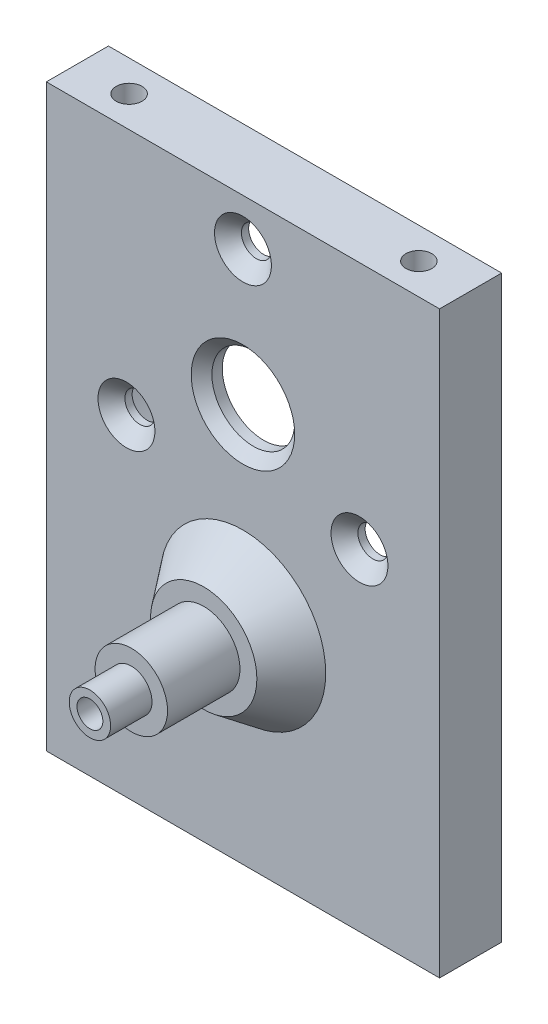
ISO-10303-21;
HEADER;
FILE_DESCRIPTION(('STEP AP214'),'2;1');
FILE_NAME('part.step','',(''),(''),'','','');
FILE_SCHEMA(('AUTOMOTIVE_DESIGN { 1 0 10303 214 1 1 1 1 }'));
ENDSEC;
DATA;
#1=APPLICATION_CONTEXT('core data for automotive mechanical design processes');
#2=APPLICATION_PROTOCOL_DEFINITION('international standard','automotive_design',2000,#1);
#3=PRODUCT_CONTEXT('',#1,'mechanical');
#4=PRODUCT('Part','Part','',(#3));
#5=PRODUCT_RELATED_PRODUCT_CATEGORY('part','',(#4));
#6=PRODUCT_DEFINITION_FORMATION('','',#4);
#7=PRODUCT_DEFINITION_CONTEXT('part definition',#1,'design');
#8=PRODUCT_DEFINITION('design','',#6,#7);
#9=PRODUCT_DEFINITION_SHAPE('','',#8);
#10=(LENGTH_UNIT() NAMED_UNIT(*) SI_UNIT(.MILLI.,.METRE.));
#11=(NAMED_UNIT(*) PLANE_ANGLE_UNIT() SI_UNIT($,.RADIAN.));
#12=(NAMED_UNIT(*) SI_UNIT($,.STERADIAN.) SOLID_ANGLE_UNIT());
#13=UNCERTAINTY_MEASURE_WITH_UNIT(LENGTH_MEASURE(1.E-05),#10,'distance_accuracy_value','');
#14=(GEOMETRIC_REPRESENTATION_CONTEXT(3) GLOBAL_UNCERTAINTY_ASSIGNED_CONTEXT((#13)) GLOBAL_UNIT_ASSIGNED_CONTEXT((#10,
#11,#12)) REPRESENTATION_CONTEXT('',''));
#15=CARTESIAN_POINT('',(0.,0.,0.));
#16=DIRECTION('',(0.,0.,1.));
#17=DIRECTION('',(1.,0.,0.));
#18=AXIS2_PLACEMENT_3D('',#15,#16,#17);
#19=CARTESIAN_POINT('',(0.,20.,16.79));
#20=DIRECTION('',(0.,0.,1.));
#21=DIRECTION('',(1.,0.,0.));
#22=AXIS2_PLACEMENT_3D('',#19,#20,#21);
#23=PLANE('',#22);
#24=CARTESIAN_POINT('',(0.,20.,16.79));
#25=DIRECTION('',(0.,0.,1.));
#26=DIRECTION('',(1.,0.,0.));
#27=AXIS2_PLACEMENT_3D('',#24,#25,#26);
#28=CIRCLE('',#27,3.5);
#29=CARTESIAN_POINT('',(3.5,20.,16.79));
#30=VERTEX_POINT('',#29);
#31=EDGE_CURVE('E157',#30,#30,#28,.T.);
#32=ORIENTED_EDGE('',*,*,#31,.T.);
#33=EDGE_LOOP('',(#32));
#34=FACE_BOUND('',#33,.T.);
#35=CARTESIAN_POINT('',(0.,20.,16.79));
#36=DIRECTION('',(0.,0.,1.));
#37=DIRECTION('',(1.,0.,0.));
#38=AXIS2_PLACEMENT_3D('',#35,#36,#37);
#39=CIRCLE('',#38,2.);
#40=CARTESIAN_POINT('',(2.,20.,16.79));
#41=VERTEX_POINT('',#40);
#42=EDGE_CURVE('E150',#41,#41,#39,.T.);
#43=ORIENTED_EDGE('',*,*,#42,.F.);
#44=EDGE_LOOP('',(#43));
#45=FACE_BOUND('',#44,.T.);
#46=ADVANCED_FACE('F37',(#34,#45),#23,.T.);
#47=CARTESIAN_POINT('',(0.,20.,9.79));
#48=DIRECTION('',(0.,0.,1.));
#49=DIRECTION('',(1.,0.,0.));
#50=AXIS2_PLACEMENT_3D('',#47,#48,#49);
#51=PLANE('',#50);
#52=CARTESIAN_POINT('',(0.,20.,9.79));
#53=DIRECTION('',(0.,0.,1.));
#54=DIRECTION('',(1.,0.,0.));
#55=AXIS2_PLACEMENT_3D('',#52,#53,#54);
#56=CIRCLE('',#55,5.13421550094518);
#57=CARTESIAN_POINT('',(5.13421550094518,20.,9.79));
#58=VERTEX_POINT('',#57);
#59=EDGE_CURVE('E222',#58,#58,#56,.T.);
#60=ORIENTED_EDGE('',*,*,#59,.T.);
#61=EDGE_LOOP('',(#60));
#62=FACE_BOUND('',#61,.T.);
#63=CARTESIAN_POINT('',(0.,20.,9.79));
#64=DIRECTION('',(0.,0.,1.));
#65=DIRECTION('',(1.,0.,0.));
#66=AXIS2_PLACEMENT_3D('',#63,#64,#65);
#67=CIRCLE('',#66,3.5);
#68=CARTESIAN_POINT('',(3.5,20.,9.79));
#69=VERTEX_POINT('',#68);
#70=EDGE_CURVE('E154',#69,#69,#67,.T.);
#71=ORIENTED_EDGE('',*,*,#70,.F.);
#72=EDGE_LOOP('',(#71));
#73=FACE_BOUND('',#72,.T.);
#74=ADVANCED_FACE('F238',(#62,#73),#51,.T.);
#75=CARTESIAN_POINT('',(0.,38.5,4.));
#76=DIRECTION('',(0.,0.,-1.));
#77=DIRECTION('',(-1.,0.,0.));
#78=AXIS2_PLACEMENT_3D('',#75,#76,#77);
#79=PLANE('',#78);
#80=CARTESIAN_POINT('',(-11.2583302491978,32.,4.));
#81=DIRECTION('',(0.,0.,-1.));
#82=DIRECTION('',(-1.,0.,0.));
#83=AXIS2_PLACEMENT_3D('',#80,#81,#82);
#84=CIRCLE('',#83,1.44999999999999);
#85=CARTESIAN_POINT('',(-12.7083302491978,32.,4.));
#86=VERTEX_POINT('',#85);
#87=EDGE_CURVE('E185',#86,#86,#84,.F.);
#88=ORIENTED_EDGE('',*,*,#87,.T.);
#89=EDGE_LOOP('',(#88));
#90=FACE_BOUND('',#89,.T.);
#91=CARTESIAN_POINT('',(0.,38.5,4.));
#92=DIRECTION('',(0.,0.,-1.));
#93=DIRECTION('',(-1.,0.,0.));
#94=AXIS2_PLACEMENT_3D('',#91,#92,#93);
#95=CIRCLE('',#94,4.00000000000001);
#96=CARTESIAN_POINT('',(-4.00000000000001,38.5,4.));
#97=VERTEX_POINT('',#96);
#98=EDGE_CURVE('E184',#97,#97,#95,.T.);
#99=ORIENTED_EDGE('',*,*,#98,.F.);
#100=EDGE_LOOP('',(#99));
#101=FACE_BOUND('',#100,.T.);
#102=CARTESIAN_POINT('',(0.,38.5,4.));
#103=DIRECTION('',(0.,0.,-1.));
#104=DIRECTION('',(-1.,0.,0.));
#105=AXIS2_PLACEMENT_3D('',#102,#103,#104);
#106=CIRCLE('',#105,16.54);
#107=CARTESIAN_POINT('',(-16.54,38.5,4.));
#108=VERTEX_POINT('',#107);
#109=EDGE_CURVE('E193',#108,#108,#106,.T.);
#110=ORIENTED_EDGE('',*,*,#109,.T.);
#111=EDGE_LOOP('',(#110));
#112=FACE_BOUND('',#111,.T.);
#113=CARTESIAN_POINT('',(11.2583302491976,31.9999999999999,4.));
#114=DIRECTION('',(0.,0.,-1.));
#115=DIRECTION('',(-1.,0.,0.));
#116=AXIS2_PLACEMENT_3D('',#113,#114,#115);
#117=CIRCLE('',#116,1.44999999999999);
#118=CARTESIAN_POINT('',(9.80833024919764,31.9999999999999,4.));
#119=VERTEX_POINT('',#118);
#120=EDGE_CURVE('E176',#119,#119,#117,.F.);
#121=ORIENTED_EDGE('',*,*,#120,.T.);
#122=EDGE_LOOP('',(#121));
#123=FACE_BOUND('',#122,.T.);
#124=CARTESIAN_POINT('',(0.,51.5,4.));
#125=DIRECTION('',(0.,0.,-1.));
#126=DIRECTION('',(-1.,0.,0.));
#127=AXIS2_PLACEMENT_3D('',#124,#125,#126);
#128=CIRCLE('',#127,1.44999999999999);
#129=CARTESIAN_POINT('',(-1.44999999999999,51.5,4.));
#130=VERTEX_POINT('',#129);
#131=EDGE_CURVE('E167',#130,#130,#128,.F.);
#132=ORIENTED_EDGE('',*,*,#131,.T.);
#133=EDGE_LOOP('',(#132));
#134=FACE_BOUND('',#133,.T.);
#135=ADVANCED_FACE('F244',(#90,#101,#112,#123,#134),#79,.T.);
#136=CARTESIAN_POINT('',(19.,56.,6.));
#137=DIRECTION('',(0.,0.,1.));
#138=DIRECTION('',(1.,0.,0.));
#139=AXIS2_PLACEMENT_3D('',#136,#137,#138);
#140=PLANE('',#139);
#141=CARTESIAN_POINT('',(0.,38.5,6.));
#142=DIRECTION('',(0.,0.,1.));
#143=DIRECTION('',(1.,0.,0.));
#144=AXIS2_PLACEMENT_3D('',#141,#142,#143);
#145=CIRCLE('',#144,5.);
#146=CARTESIAN_POINT('',(5.,38.5,6.));
#147=VERTEX_POINT('',#146);
#148=EDGE_CURVE('E46',#147,#147,#145,.F.);
#149=ORIENTED_EDGE('',*,*,#148,.T.);
#150=EDGE_LOOP('',(#149));
#151=FACE_BOUND('',#150,.T.);
#152=CARTESIAN_POINT('',(0.,20.,6.));
#153=DIRECTION('',(0.,0.,1.));
#154=DIRECTION('',(1.,0.,0.));
#155=AXIS2_PLACEMENT_3D('',#152,#153,#154);
#156=CIRCLE('',#155,8.);
#157=CARTESIAN_POINT('',(8.,20.,6.));
#158=VERTEX_POINT('',#157);
#159=EDGE_CURVE('E219',#158,#158,#156,.F.);
#160=ORIENTED_EDGE('',*,*,#159,.T.);
#161=EDGE_LOOP('',(#160));
#162=FACE_BOUND('',#161,.T.);
#163=CARTESIAN_POINT('',(0.,51.5,6.));
#164=DIRECTION('',(0.,0.,1.));
#165=DIRECTION('',(1.,0.,0.));
#166=AXIS2_PLACEMENT_3D('',#163,#164,#165);
#167=CIRCLE('',#166,2.75);
#168=CARTESIAN_POINT('',(2.75,51.5,6.));
#169=VERTEX_POINT('',#168);
#170=EDGE_CURVE('E160',#169,#169,#167,.T.);
#171=ORIENTED_EDGE('',*,*,#170,.F.);
#172=EDGE_LOOP('',(#171));
#173=FACE_BOUND('',#172,.T.);
#174=CARTESIAN_POINT('',(11.2583302491976,31.9999999999999,6.));
#175=DIRECTION('',(0.,0.,1.));
#176=DIRECTION('',(1.,0.,0.));
#177=AXIS2_PLACEMENT_3D('',#174,#175,#176);
#178=CIRCLE('',#177,2.75);
#179=CARTESIAN_POINT('',(14.0083302491976,31.9999999999999,6.));
#180=VERTEX_POINT('',#179);
#181=EDGE_CURVE('E166',#180,#180,#178,.T.);
#182=ORIENTED_EDGE('',*,*,#181,.F.);
#183=EDGE_LOOP('',(#182));
#184=FACE_BOUND('',#183,.T.);
#185=CARTESIAN_POINT('',(-11.2583302491978,32.,6.));
#186=DIRECTION('',(0.,0.,1.));
#187=DIRECTION('',(1.,0.,0.));
#188=AXIS2_PLACEMENT_3D('',#185,#186,#187);
#189=CIRCLE('',#188,2.75);
#190=CARTESIAN_POINT('',(-8.50833024919783,32.,6.));
#191=VERTEX_POINT('',#190);
#192=EDGE_CURVE('E175',#191,#191,#189,.T.);
#193=ORIENTED_EDGE('',*,*,#192,.F.);
#194=EDGE_LOOP('',(#193));
#195=FACE_BOUND('',#194,.T.);
#196=DIRECTION('',(0.,1.,0.));
#197=VECTOR('',#196,1.);
#198=CARTESIAN_POINT('',(19.,0.,6.));
#199=LINE('',#198,#197);
#200=CARTESIAN_POINT('',(19.,0.,6.));
#201=VERTEX_POINT('',#200);
#202=CARTESIAN_POINT('',(19.,56.,6.));
#203=VERTEX_POINT('',#202);
#204=EDGE_CURVE('E199',#201,#203,#199,.T.);
#205=ORIENTED_EDGE('',*,*,#204,.T.);
#206=DIRECTION('',(-1.,0.,0.));
#207=VECTOR('',#206,1.);
#208=CARTESIAN_POINT('',(19.,56.,6.));
#209=LINE('',#208,#207);
#210=CARTESIAN_POINT('',(-19.,56.,6.));
#211=VERTEX_POINT('',#210);
#212=EDGE_CURVE('E86',#203,#211,#209,.T.);
#213=ORIENTED_EDGE('',*,*,#212,.T.);
#214=DIRECTION('',(0.,-1.,0.));
#215=VECTOR('',#214,1.);
#216=CARTESIAN_POINT('',(-19.,56.,6.));
#217=LINE('',#216,#215);
#218=CARTESIAN_POINT('',(-19.,0.,6.));
#219=VERTEX_POINT('',#218);
#220=EDGE_CURVE('E202',#211,#219,#217,.T.);
#221=ORIENTED_EDGE('',*,*,#220,.T.);
#222=DIRECTION('',(1.,0.,0.));
#223=VECTOR('',#222,1.);
#224=CARTESIAN_POINT('',(-19.,0.,6.));
#225=LINE('',#224,#223);
#226=EDGE_CURVE('E54',#219,#201,#225,.T.);
#227=ORIENTED_EDGE('',*,*,#226,.T.);
#228=EDGE_LOOP('',(#205,#213,#221,#227));
#229=FACE_BOUND('',#228,.T.);
#230=ADVANCED_FACE('F227',(#151,#162,#173,#184,#195,#229),#140,.T.);
#231=CARTESIAN_POINT('',(19.,56.,0.));
#232=DIRECTION('',(0.,0.,1.));
#233=DIRECTION('',(1.,0.,0.));
#234=AXIS2_PLACEMENT_3D('',#231,#232,#233);
#235=PLANE('',#234);
#236=DIRECTION('',(0.,1.,0.));
#237=VECTOR('',#236,1.);
#238=CARTESIAN_POINT('',(19.,0.,0.));
#239=LINE('',#238,#237);
#240=CARTESIAN_POINT('',(19.,0.,0.));
#241=VERTEX_POINT('',#240);
#242=CARTESIAN_POINT('',(19.,56.,0.));
#243=VERTEX_POINT('',#242);
#244=EDGE_CURVE('E196',#241,#243,#239,.T.);
#245=ORIENTED_EDGE('',*,*,#244,.F.);
#246=DIRECTION('',(1.,0.,0.));
#247=VECTOR('',#246,1.);
#248=CARTESIAN_POINT('',(-19.,0.,0.));
#249=LINE('',#248,#247);
#250=CARTESIAN_POINT('',(-19.,0.,0.));
#251=VERTEX_POINT('',#250);
#252=EDGE_CURVE('E78',#251,#241,#249,.T.);
#253=ORIENTED_EDGE('',*,*,#252,.F.);
#254=DIRECTION('',(0.,-1.,0.));
#255=VECTOR('',#254,1.);
#256=CARTESIAN_POINT('',(-19.,56.,0.));
#257=LINE('',#256,#255);
#258=CARTESIAN_POINT('',(-19.,56.,0.));
#259=VERTEX_POINT('',#258);
#260=EDGE_CURVE('E72',#259,#251,#257,.T.);
#261=ORIENTED_EDGE('',*,*,#260,.F.);
#262=DIRECTION('',(-1.,0.,0.));
#263=VECTOR('',#262,1.);
#264=CARTESIAN_POINT('',(19.,56.,0.));
#265=LINE('',#264,#263);
#266=EDGE_CURVE('E208',#243,#259,#265,.T.);
#267=ORIENTED_EDGE('',*,*,#266,.F.);
#268=EDGE_LOOP('',(#245,#253,#261,#267));
#269=FACE_BOUND('',#268,.T.);
#270=CARTESIAN_POINT('',(0.,38.5,0.));
#271=DIRECTION('',(0.,0.,-1.));
#272=DIRECTION('',(-1.,0.,0.));
#273=AXIS2_PLACEMENT_3D('',#270,#271,#272);
#274=CIRCLE('',#273,16.54);
#275=CARTESIAN_POINT('',(-16.54,38.5,0.));
#276=VERTEX_POINT('',#275);
#277=EDGE_CURVE('E192',#276,#276,#274,.T.);
#278=ORIENTED_EDGE('',*,*,#277,.F.);
#279=EDGE_LOOP('',(#278));
#280=FACE_BOUND('',#279,.T.);
#281=ADVANCED_FACE('F294',(#269,#280),#235,.F.);
#282=CARTESIAN_POINT('',(19.,0.,6.));
#283=DIRECTION('',(-1.,0.,0.));
#284=DIRECTION('',(0.,0.,1.));
#285=AXIS2_PLACEMENT_3D('',#282,#283,#284);
#286=PLANE('',#285);
#287=ORIENTED_EDGE('',*,*,#244,.T.);
#288=DIRECTION('',(0.,0.,-1.));
#289=VECTOR('',#288,1.);
#290=CARTESIAN_POINT('',(19.,56.,6.));
#291=LINE('',#290,#289);
#292=EDGE_CURVE('E217',#203,#243,#291,.T.);
#293=ORIENTED_EDGE('',*,*,#292,.F.);
#294=ORIENTED_EDGE('',*,*,#204,.F.);
#295=DIRECTION('',(0.,0.,-1.));
#296=VECTOR('',#295,1.);
#297=CARTESIAN_POINT('',(19.,0.,6.));
#298=LINE('',#297,#296);
#299=EDGE_CURVE('E205',#201,#241,#298,.T.);
#300=ORIENTED_EDGE('',*,*,#299,.T.);
#301=EDGE_LOOP('',(#287,#293,#294,#300));
#302=FACE_BOUND('',#301,.T.);
#303=ADVANCED_FACE('F297',(#302),#286,.F.);
#304=CARTESIAN_POINT('',(19.,56.,6.));
#305=DIRECTION('',(0.,-1.,0.));
#306=DIRECTION('',(1.,0.,0.));
#307=AXIS2_PLACEMENT_3D('',#304,#305,#306);
#308=PLANE('',#307);
#309=CARTESIAN_POINT('',(-14.,56.,3.));
#310=DIRECTION('',(0.,1.,0.));
#311=DIRECTION('',(0.,0.,1.));
#312=AXIS2_PLACEMENT_3D('',#309,#310,#311);
#313=CIRCLE('',#312,1.24999999999999);
#314=CARTESIAN_POINT('',(-14.,56.,4.24999999999999));
#315=VERTEX_POINT('',#314);
#316=EDGE_CURVE('E116',#315,#315,#313,.T.);
#317=ORIENTED_EDGE('',*,*,#316,.F.);
#318=EDGE_LOOP('',(#317));
#319=FACE_BOUND('',#318,.T.);
#320=CARTESIAN_POINT('',(14.,56.,3.));
#321=DIRECTION('',(0.,1.,0.));
#322=DIRECTION('',(0.,0.,1.));
#323=AXIS2_PLACEMENT_3D('',#320,#321,#322);
#324=CIRCLE('',#323,1.24999999999999);
#325=CARTESIAN_POINT('',(14.,56.,4.24999999999999));
#326=VERTEX_POINT('',#325);
#327=EDGE_CURVE('E115',#326,#326,#324,.T.);
#328=ORIENTED_EDGE('',*,*,#327,.F.);
#329=EDGE_LOOP('',(#328));
#330=FACE_BOUND('',#329,.T.);
#331=ORIENTED_EDGE('',*,*,#266,.T.);
#332=DIRECTION('',(0.,0.,-1.));
#333=VECTOR('',#332,1.);
#334=CARTESIAN_POINT('',(-19.,56.,6.));
#335=LINE('',#334,#333);
#336=EDGE_CURVE('E215',#211,#259,#335,.T.);
#337=ORIENTED_EDGE('',*,*,#336,.F.);
#338=ORIENTED_EDGE('',*,*,#212,.F.);
#339=ORIENTED_EDGE('',*,*,#292,.T.);
#340=EDGE_LOOP('',(#331,#337,#338,#339));
#341=FACE_BOUND('',#340,.T.);
#342=ADVANCED_FACE('F305',(#319,#330,#341),#308,.F.);
#343=CARTESIAN_POINT('',(-19.,56.,6.));
#344=DIRECTION('',(1.,0.,0.));
#345=DIRECTION('',(0.,0.,-1.));
#346=AXIS2_PLACEMENT_3D('',#343,#344,#345);
#347=PLANE('',#346);
#348=ORIENTED_EDGE('',*,*,#260,.T.);
#349=DIRECTION('',(0.,0.,-1.));
#350=VECTOR('',#349,1.);
#351=CARTESIAN_POINT('',(-19.,0.,6.));
#352=LINE('',#351,#350);
#353=EDGE_CURVE('E213',#219,#251,#352,.T.);
#354=ORIENTED_EDGE('',*,*,#353,.F.);
#355=ORIENTED_EDGE('',*,*,#220,.F.);
#356=ORIENTED_EDGE('',*,*,#336,.T.);
#357=EDGE_LOOP('',(#348,#354,#355,#356));
#358=FACE_BOUND('',#357,.T.);
#359=ADVANCED_FACE('F301',(#358),#347,.F.);
#360=CARTESIAN_POINT('',(-19.,0.,6.));
#361=DIRECTION('',(0.,1.,0.));
#362=DIRECTION('',(0.,0.,1.));
#363=AXIS2_PLACEMENT_3D('',#360,#361,#362);
#364=PLANE('',#363);
#365=CARTESIAN_POINT('',(-12.,0.,3.));
#366=DIRECTION('',(0.,-1.,0.));
#367=DIRECTION('',(0.,0.,-1.));
#368=AXIS2_PLACEMENT_3D('',#365,#366,#367);
#369=CIRCLE('',#368,1.24999999999999);
#370=CARTESIAN_POINT('',(-12.,0.,1.75000000000001));
#371=VERTEX_POINT('',#370);
#372=EDGE_CURVE('E126',#371,#371,#369,.T.);
#373=ORIENTED_EDGE('',*,*,#372,.F.);
#374=EDGE_LOOP('',(#373));
#375=FACE_BOUND('',#374,.T.);
#376=CARTESIAN_POINT('',(0.,0.,3.));
#377=DIRECTION('',(0.,-1.,0.));
#378=DIRECTION('',(0.,0.,-1.));
#379=AXIS2_PLACEMENT_3D('',#376,#377,#378);
#380=CIRCLE('',#379,1.24999999999999);
#381=CARTESIAN_POINT('',(0.,0.,1.75000000000001));
#382=VERTEX_POINT('',#381);
#383=EDGE_CURVE('E132',#382,#382,#380,.T.);
#384=ORIENTED_EDGE('',*,*,#383,.F.);
#385=EDGE_LOOP('',(#384));
#386=FACE_BOUND('',#385,.T.);
#387=CARTESIAN_POINT('',(12.,0.,3.));
#388=DIRECTION('',(0.,-1.,0.));
#389=DIRECTION('',(0.,0.,-1.));
#390=AXIS2_PLACEMENT_3D('',#387,#388,#389);
#391=CIRCLE('',#390,1.24999999999999);
#392=CARTESIAN_POINT('',(12.,0.,1.75000000000001));
#393=VERTEX_POINT('',#392);
#394=EDGE_CURVE('E138',#393,#393,#391,.T.);
#395=ORIENTED_EDGE('',*,*,#394,.F.);
#396=EDGE_LOOP('',(#395));
#397=FACE_BOUND('',#396,.T.);
#398=ORIENTED_EDGE('',*,*,#252,.T.);
#399=ORIENTED_EDGE('',*,*,#299,.F.);
#400=ORIENTED_EDGE('',*,*,#226,.F.);
#401=ORIENTED_EDGE('',*,*,#353,.T.);
#402=EDGE_LOOP('',(#398,#399,#400,#401));
#403=FACE_BOUND('',#402,.T.);
#404=ADVANCED_FACE('F290',(#375,#386,#397,#403),#364,.F.);
#405=CARTESIAN_POINT('',(0.,38.5,4.));
#406=DIRECTION('',(0.,0.,-1.));
#407=DIRECTION('',(-1.,0.,0.));
#408=AXIS2_PLACEMENT_3D('',#405,#406,#407);
#409=CYLINDRICAL_SURFACE('',#408,16.54);
#410=ORIENTED_EDGE('',*,*,#277,.T.);
#411=EDGE_LOOP('',(#410));
#412=FACE_BOUND('',#411,.T.);
#413=ORIENTED_EDGE('',*,*,#109,.F.);
#414=EDGE_LOOP('',(#413));
#415=FACE_BOUND('',#414,.T.);
#416=ADVANCED_FACE('F283',(#412,#415),#409,.F.);
#417=CARTESIAN_POINT('',(0.,38.5,6.));
#418=DIRECTION('',(0.,0.,-1.));
#419=DIRECTION('',(-1.,0.,0.));
#420=AXIS2_PLACEMENT_3D('',#417,#418,#419);
#421=CYLINDRICAL_SURFACE('',#420,4.00000000000001);
#422=CARTESIAN_POINT('',(0.,38.5,5.00000000000001));
#423=DIRECTION('',(0.,0.,1.));
#424=DIRECTION('',(1.,0.,0.));
#425=AXIS2_PLACEMENT_3D('',#422,#423,#424);
#426=CIRCLE('',#425,4.00000000000001);
#427=CARTESIAN_POINT('',(4.00000000000001,38.5,5.00000000000001));
#428=VERTEX_POINT('',#427);
#429=EDGE_CURVE('E11',#428,#428,#426,.T.);
#430=ORIENTED_EDGE('',*,*,#429,.T.);
#431=EDGE_LOOP('',(#430));
#432=FACE_BOUND('',#431,.T.);
#433=ORIENTED_EDGE('',*,*,#98,.T.);
#434=EDGE_LOOP('',(#433));
#435=FACE_BOUND('',#434,.T.);
#436=ADVANCED_FACE('F276',(#432,#435),#421,.F.);
#437=CARTESIAN_POINT('',(-11.2583302491978,32.,6.));
#438=DIRECTION('',(0.,0.,1.));
#439=DIRECTION('',(1.,0.,0.));
#440=AXIS2_PLACEMENT_3D('',#437,#438,#439);
#441=CYLINDRICAL_SURFACE('',#440,1.44999999999999);
#442=ORIENTED_EDGE('',*,*,#87,.F.);
#443=EDGE_LOOP('',(#442));
#444=FACE_BOUND('',#443,.T.);
#445=CARTESIAN_POINT('',(-11.2583302491978,32.,4.69999999999999));
#446=DIRECTION('',(0.,0.,1.));
#447=DIRECTION('',(1.,0.,0.));
#448=AXIS2_PLACEMENT_3D('',#445,#446,#447);
#449=CIRCLE('',#448,1.44999999999999);
#450=CARTESIAN_POINT('',(-9.80833024919784,32.,4.69999999999999));
#451=VERTEX_POINT('',#450);
#452=EDGE_CURVE('E181',#451,#451,#449,.T.);
#453=ORIENTED_EDGE('',*,*,#452,.T.);
#454=EDGE_LOOP('',(#453));
#455=FACE_BOUND('',#454,.T.);
#456=ADVANCED_FACE('F273',(#444,#455),#441,.F.);
#457=CARTESIAN_POINT('',(-11.2583302491978,32.,6.));
#458=DIRECTION('',(0.,0.,1.));
#459=DIRECTION('',(1.,0.,0.));
#460=AXIS2_PLACEMENT_3D('',#457,#458,#459);
#461=CONICAL_SURFACE('',#460,2.75,0.785398163397448);
#462=ORIENTED_EDGE('',*,*,#452,.F.);
#463=EDGE_LOOP('',(#462));
#464=FACE_BOUND('',#463,.T.);
#465=ORIENTED_EDGE('',*,*,#192,.T.);
#466=EDGE_LOOP('',(#465));
#467=FACE_BOUND('',#466,.T.);
#468=ADVANCED_FACE('F268',(#464,#467),#461,.F.);
#469=CARTESIAN_POINT('',(11.2583302491976,31.9999999999999,6.));
#470=DIRECTION('',(0.,0.,1.));
#471=DIRECTION('',(1.,0.,0.));
#472=AXIS2_PLACEMENT_3D('',#469,#470,#471);
#473=CYLINDRICAL_SURFACE('',#472,1.44999999999999);
#474=ORIENTED_EDGE('',*,*,#120,.F.);
#475=EDGE_LOOP('',(#474));
#476=FACE_BOUND('',#475,.T.);
#477=CARTESIAN_POINT('',(11.2583302491976,31.9999999999999,4.69999999999999));
#478=DIRECTION('',(0.,0.,1.));
#479=DIRECTION('',(1.,0.,0.));
#480=AXIS2_PLACEMENT_3D('',#477,#478,#479);
#481=CIRCLE('',#480,1.44999999999999);
#482=CARTESIAN_POINT('',(12.7083302491976,31.9999999999999,4.69999999999999));
#483=VERTEX_POINT('',#482);
#484=EDGE_CURVE('E172',#483,#483,#481,.T.);
#485=ORIENTED_EDGE('',*,*,#484,.T.);
#486=EDGE_LOOP('',(#485));
#487=FACE_BOUND('',#486,.T.);
#488=ADVANCED_FACE('F265',(#476,#487),#473,.F.);
#489=CARTESIAN_POINT('',(11.2583302491976,31.9999999999999,6.));
#490=DIRECTION('',(0.,0.,1.));
#491=DIRECTION('',(1.,0.,0.));
#492=AXIS2_PLACEMENT_3D('',#489,#490,#491);
#493=CONICAL_SURFACE('',#492,2.75,0.785398163397448);
#494=ORIENTED_EDGE('',*,*,#484,.F.);
#495=EDGE_LOOP('',(#494));
#496=FACE_BOUND('',#495,.T.);
#497=ORIENTED_EDGE('',*,*,#181,.T.);
#498=EDGE_LOOP('',(#497));
#499=FACE_BOUND('',#498,.T.);
#500=ADVANCED_FACE('F260',(#496,#499),#493,.F.);
#501=CARTESIAN_POINT('',(0.,51.5,6.));
#502=DIRECTION('',(0.,0.,1.));
#503=DIRECTION('',(1.,0.,0.));
#504=AXIS2_PLACEMENT_3D('',#501,#502,#503);
#505=CYLINDRICAL_SURFACE('',#504,1.44999999999999);
#506=ORIENTED_EDGE('',*,*,#131,.F.);
#507=EDGE_LOOP('',(#506));
#508=FACE_BOUND('',#507,.T.);
#509=CARTESIAN_POINT('',(0.,51.5,4.69999999999999));
#510=DIRECTION('',(0.,0.,1.));
#511=DIRECTION('',(1.,0.,0.));
#512=AXIS2_PLACEMENT_3D('',#509,#510,#511);
#513=CIRCLE('',#512,1.44999999999999);
#514=CARTESIAN_POINT('',(1.44999999999999,51.5,4.69999999999999));
#515=VERTEX_POINT('',#514);
#516=EDGE_CURVE('E163',#515,#515,#513,.T.);
#517=ORIENTED_EDGE('',*,*,#516,.T.);
#518=EDGE_LOOP('',(#517));
#519=FACE_BOUND('',#518,.T.);
#520=ADVANCED_FACE('F257',(#508,#519),#505,.F.);
#521=CARTESIAN_POINT('',(0.,51.5,6.));
#522=DIRECTION('',(0.,0.,1.));
#523=DIRECTION('',(1.,0.,0.));
#524=AXIS2_PLACEMENT_3D('',#521,#522,#523);
#525=CONICAL_SURFACE('',#524,2.75,0.785398163397448);
#526=ORIENTED_EDGE('',*,*,#516,.F.);
#527=EDGE_LOOP('',(#526));
#528=FACE_BOUND('',#527,.T.);
#529=ORIENTED_EDGE('',*,*,#170,.T.);
#530=EDGE_LOOP('',(#529));
#531=FACE_BOUND('',#530,.T.);
#532=ADVANCED_FACE('F254',(#528,#531),#525,.F.);
#533=CARTESIAN_POINT('',(0.,20.,16.79));
#534=DIRECTION('',(0.,0.,-1.));
#535=DIRECTION('',(-1.,0.,0.));
#536=AXIS2_PLACEMENT_3D('',#533,#534,#535);
#537=CYLINDRICAL_SURFACE('',#536,3.5);
#538=ORIENTED_EDGE('',*,*,#31,.F.);
#539=EDGE_LOOP('',(#538));
#540=FACE_BOUND('',#539,.T.);
#541=ORIENTED_EDGE('',*,*,#70,.T.);
#542=EDGE_LOOP('',(#541));
#543=FACE_BOUND('',#542,.T.);
#544=ADVANCED_FACE('F252',(#540,#543),#537,.T.);
#545=CARTESIAN_POINT('',(0.,20.,20.79));
#546=DIRECTION('',(0.,0.,-1.));
#547=DIRECTION('',(-1.,0.,0.));
#548=AXIS2_PLACEMENT_3D('',#545,#546,#547);
#549=CYLINDRICAL_SURFACE('',#548,2.);
#550=CARTESIAN_POINT('',(0.,20.,20.79));
#551=DIRECTION('',(0.,0.,1.));
#552=DIRECTION('',(1.,0.,0.));
#553=AXIS2_PLACEMENT_3D('',#550,#551,#552);
#554=CIRCLE('',#553,2.);
#555=CARTESIAN_POINT('',(2.,20.,20.79));
#556=VERTEX_POINT('',#555);
#557=EDGE_CURVE('E151',#556,#556,#554,.T.);
#558=ORIENTED_EDGE('',*,*,#557,.F.);
#559=EDGE_LOOP('',(#558));
#560=FACE_BOUND('',#559,.T.);
#561=ORIENTED_EDGE('',*,*,#42,.T.);
#562=EDGE_LOOP('',(#561));
#563=FACE_BOUND('',#562,.T.);
#564=ADVANCED_FACE('F250',(#560,#563),#549,.T.);
#565=CARTESIAN_POINT('',(0.,20.,20.79));
#566=DIRECTION('',(0.,0.,1.));
#567=DIRECTION('',(1.,0.,0.));
#568=AXIS2_PLACEMENT_3D('',#565,#566,#567);
#569=PLANE('',#568);
#570=CARTESIAN_POINT('',(0.,20.,20.79));
#571=DIRECTION('',(0.,0.,1.));
#572=DIRECTION('',(1.,0.,0.));
#573=AXIS2_PLACEMENT_3D('',#570,#571,#572);
#574=CIRCLE('',#573,1.24999999999999);
#575=CARTESIAN_POINT('',(1.24999999999999,20.,20.79));
#576=VERTEX_POINT('',#575);
#577=EDGE_CURVE('E144',#576,#576,#574,.T.);
#578=ORIENTED_EDGE('',*,*,#577,.F.);
#579=EDGE_LOOP('',(#578));
#580=FACE_BOUND('',#579,.T.);
#581=ORIENTED_EDGE('',*,*,#557,.T.);
#582=EDGE_LOOP('',(#581));
#583=FACE_BOUND('',#582,.T.);
#584=ADVANCED_FACE('F314',(#580,#583),#569,.T.);
#585=CARTESIAN_POINT('',(0.,20.,11.29));
#586=DIRECTION('',(0.,0.,-1.));
#587=DIRECTION('',(-1.,0.,0.));
#588=AXIS2_PLACEMENT_3D('',#585,#586,#587);
#589=CONICAL_SURFACE('',#588,4.,0.647421474716012);
#590=ORIENTED_EDGE('',*,*,#159,.F.);
#591=EDGE_LOOP('',(#590));
#592=FACE_BOUND('',#591,.T.);
#593=ORIENTED_EDGE('',*,*,#59,.F.);
#594=EDGE_LOOP('',(#593));
#595=FACE_BOUND('',#594,.T.);
#596=ADVANCED_FACE('F311',(#592,#595),#589,.T.);
#597=CARTESIAN_POINT('',(0.,20.,10.79));
#598=DIRECTION('',(0.,0.,1.));
#599=DIRECTION('',(1.,0.,0.));
#600=AXIS2_PLACEMENT_3D('',#597,#598,#599);
#601=CONICAL_SURFACE('',#600,1.25,1.02974425867665);
#602=CARTESIAN_POINT('',(0.,20.,10.0389242262155));
#603=VERTEX_POINT('',#602);
#604=VERTEX_LOOP('',#603);
#605=FACE_BOUND('',#604,.T.);
#606=CARTESIAN_POINT('',(0.,20.,10.79));
#607=DIRECTION('',(0.,0.,1.));
#608=DIRECTION('',(1.,0.,0.));
#609=AXIS2_PLACEMENT_3D('',#606,#607,#608);
#610=CIRCLE('',#609,1.25);
#611=CARTESIAN_POINT('',(1.25,20.,10.79));
#612=VERTEX_POINT('',#611);
#613=EDGE_CURVE('E147',#612,#612,#610,.T.);
#614=ORIENTED_EDGE('',*,*,#613,.T.);
#615=EDGE_LOOP('',(#614));
#616=FACE_BOUND('',#615,.T.);
#617=ADVANCED_FACE('F313',(#605,#616),#601,.F.);
#618=CARTESIAN_POINT('',(0.,20.,20.79));
#619=DIRECTION('',(0.,0.,1.));
#620=DIRECTION('',(1.,0.,0.));
#621=AXIS2_PLACEMENT_3D('',#618,#619,#620);
#622=CYLINDRICAL_SURFACE('',#621,1.24999999999999);
#623=ORIENTED_EDGE('',*,*,#613,.F.);
#624=EDGE_LOOP('',(#623));
#625=FACE_BOUND('',#624,.T.);
#626=ORIENTED_EDGE('',*,*,#577,.T.);
#627=EDGE_LOOP('',(#626));
#628=FACE_BOUND('',#627,.T.);
#629=ADVANCED_FACE('F320',(#625,#628),#622,.F.);
#630=CARTESIAN_POINT('',(12.,8.50000000000001,3.));
#631=DIRECTION('',(0.,-1.,0.));
#632=DIRECTION('',(0.,0.,-1.));
#633=AXIS2_PLACEMENT_3D('',#630,#631,#632);
#634=CONICAL_SURFACE('',#633,1.24999999999999,1.02974425867665);
#635=CARTESIAN_POINT('',(12.,9.25107577378445,3.));
#636=VERTEX_POINT('',#635);
#637=VERTEX_LOOP('',#636);
#638=FACE_BOUND('',#637,.T.);
#639=CARTESIAN_POINT('',(12.,8.50000000000001,3.));
#640=DIRECTION('',(0.,-1.,0.));
#641=DIRECTION('',(0.,0.,-1.));
#642=AXIS2_PLACEMENT_3D('',#639,#640,#641);
#643=CIRCLE('',#642,1.24999999999999);
#644=CARTESIAN_POINT('',(12.,8.50000000000001,1.75000000000001));
#645=VERTEX_POINT('',#644);
#646=EDGE_CURVE('E141',#645,#645,#643,.T.);
#647=ORIENTED_EDGE('',*,*,#646,.T.);
#648=EDGE_LOOP('',(#647));
#649=FACE_BOUND('',#648,.T.);
#650=ADVANCED_FACE('F365',(#638,#649),#634,.F.);
#651=CARTESIAN_POINT('',(12.,0.,3.));
#652=DIRECTION('',(0.,-1.,0.));
#653=DIRECTION('',(0.,0.,-1.));
#654=AXIS2_PLACEMENT_3D('',#651,#652,#653);
#655=CYLINDRICAL_SURFACE('',#654,1.24999999999999);
#656=ORIENTED_EDGE('',*,*,#646,.F.);
#657=EDGE_LOOP('',(#656));
#658=FACE_BOUND('',#657,.T.);
#659=ORIENTED_EDGE('',*,*,#394,.T.);
#660=EDGE_LOOP('',(#659));
#661=FACE_BOUND('',#660,.T.);
#662=ADVANCED_FACE('F369',(#658,#661),#655,.F.);
#663=CARTESIAN_POINT('',(0.,8.50000000000001,3.));
#664=DIRECTION('',(0.,-1.,0.));
#665=DIRECTION('',(0.,0.,-1.));
#666=AXIS2_PLACEMENT_3D('',#663,#664,#665);
#667=CONICAL_SURFACE('',#666,1.24999999999999,1.02974425867665);
#668=CARTESIAN_POINT('',(0.,9.25107577378445,3.));
#669=VERTEX_POINT('',#668);
#670=VERTEX_LOOP('',#669);
#671=FACE_BOUND('',#670,.T.);
#672=CARTESIAN_POINT('',(0.,8.50000000000001,3.));
#673=DIRECTION('',(0.,-1.,0.));
#674=DIRECTION('',(0.,0.,-1.));
#675=AXIS2_PLACEMENT_3D('',#672,#673,#674);
#676=CIRCLE('',#675,1.24999999999999);
#677=CARTESIAN_POINT('',(0.,8.50000000000001,1.75000000000001));
#678=VERTEX_POINT('',#677);
#679=EDGE_CURVE('E135',#678,#678,#676,.T.);
#680=ORIENTED_EDGE('',*,*,#679,.T.);
#681=EDGE_LOOP('',(#680));
#682=FACE_BOUND('',#681,.T.);
#683=ADVANCED_FACE('F373',(#671,#682),#667,.F.);
#684=CARTESIAN_POINT('',(0.,0.,3.));
#685=DIRECTION('',(0.,-1.,0.));
#686=DIRECTION('',(0.,0.,-1.));
#687=AXIS2_PLACEMENT_3D('',#684,#685,#686);
#688=CYLINDRICAL_SURFACE('',#687,1.24999999999999);
#689=ORIENTED_EDGE('',*,*,#679,.F.);
#690=EDGE_LOOP('',(#689));
#691=FACE_BOUND('',#690,.T.);
#692=ORIENTED_EDGE('',*,*,#383,.T.);
#693=EDGE_LOOP('',(#692));
#694=FACE_BOUND('',#693,.T.);
#695=ADVANCED_FACE('F377',(#691,#694),#688,.F.);
#696=CARTESIAN_POINT('',(-12.,8.50000000000001,3.));
#697=DIRECTION('',(0.,-1.,0.));
#698=DIRECTION('',(0.,0.,-1.));
#699=AXIS2_PLACEMENT_3D('',#696,#697,#698);
#700=CONICAL_SURFACE('',#699,1.24999999999999,1.02974425867665);
#701=CARTESIAN_POINT('',(-12.,9.25107577378445,3.));
#702=VERTEX_POINT('',#701);
#703=VERTEX_LOOP('',#702);
#704=FACE_BOUND('',#703,.T.);
#705=CARTESIAN_POINT('',(-12.,8.50000000000001,3.));
#706=DIRECTION('',(0.,-1.,0.));
#707=DIRECTION('',(0.,0.,-1.));
#708=AXIS2_PLACEMENT_3D('',#705,#706,#707);
#709=CIRCLE('',#708,1.24999999999999);
#710=CARTESIAN_POINT('',(-12.,8.50000000000001,1.75000000000001));
#711=VERTEX_POINT('',#710);
#712=EDGE_CURVE('E129',#711,#711,#709,.T.);
#713=ORIENTED_EDGE('',*,*,#712,.T.);
#714=EDGE_LOOP('',(#713));
#715=FACE_BOUND('',#714,.T.);
#716=ADVANCED_FACE('F381',(#704,#715),#700,.F.);
#717=CARTESIAN_POINT('',(-12.,0.,3.));
#718=DIRECTION('',(0.,-1.,0.));
#719=DIRECTION('',(0.,0.,-1.));
#720=AXIS2_PLACEMENT_3D('',#717,#718,#719);
#721=CYLINDRICAL_SURFACE('',#720,1.24999999999999);
#722=ORIENTED_EDGE('',*,*,#712,.F.);
#723=EDGE_LOOP('',(#722));
#724=FACE_BOUND('',#723,.T.);
#725=ORIENTED_EDGE('',*,*,#372,.T.);
#726=EDGE_LOOP('',(#725));
#727=FACE_BOUND('',#726,.T.);
#728=ADVANCED_FACE('F385',(#724,#727),#721,.F.);
#729=CARTESIAN_POINT('',(14.,50.,3.));
#730=DIRECTION('',(0.,1.,0.));
#731=DIRECTION('',(0.,0.,1.));
#732=AXIS2_PLACEMENT_3D('',#729,#730,#731);
#733=CONICAL_SURFACE('',#732,1.25,1.02974425867665);
#734=CARTESIAN_POINT('',(14.,49.2489242262155,3.));
#735=VERTEX_POINT('',#734);
#736=VERTEX_LOOP('',#735);
#737=FACE_BOUND('',#736,.T.);
#738=CARTESIAN_POINT('',(14.,50.,3.));
#739=DIRECTION('',(0.,1.,0.));
#740=DIRECTION('',(0.,0.,1.));
#741=AXIS2_PLACEMENT_3D('',#738,#739,#740);
#742=CIRCLE('',#741,1.25);
#743=CARTESIAN_POINT('',(14.,50.,4.25));
#744=VERTEX_POINT('',#743);
#745=EDGE_CURVE('E119',#744,#744,#742,.T.);
#746=ORIENTED_EDGE('',*,*,#745,.T.);
#747=EDGE_LOOP('',(#746));
#748=FACE_BOUND('',#747,.T.);
#749=ADVANCED_FACE('F389',(#737,#748),#733,.F.);
#750=CARTESIAN_POINT('',(14.,56.,3.));
#751=DIRECTION('',(0.,1.,0.));
#752=DIRECTION('',(0.,0.,1.));
#753=AXIS2_PLACEMENT_3D('',#750,#751,#752);
#754=CYLINDRICAL_SURFACE('',#753,1.24999999999999);
#755=ORIENTED_EDGE('',*,*,#745,.F.);
#756=EDGE_LOOP('',(#755));
#757=FACE_BOUND('',#756,.T.);
#758=ORIENTED_EDGE('',*,*,#327,.T.);
#759=EDGE_LOOP('',(#758));
#760=FACE_BOUND('',#759,.T.);
#761=ADVANCED_FACE('F109',(#757,#760),#754,.F.);
#762=CARTESIAN_POINT('',(-14.,50.,3.));
#763=DIRECTION('',(0.,1.,0.));
#764=DIRECTION('',(0.,0.,1.));
#765=AXIS2_PLACEMENT_3D('',#762,#763,#764);
#766=CONICAL_SURFACE('',#765,1.25,1.02974425867665);
#767=CARTESIAN_POINT('',(-14.,49.2489242262155,3.));
#768=VERTEX_POINT('',#767);
#769=VERTEX_LOOP('',#768);
#770=FACE_BOUND('',#769,.T.);
#771=CARTESIAN_POINT('',(-14.,50.,3.));
#772=DIRECTION('',(0.,1.,0.));
#773=DIRECTION('',(0.,0.,1.));
#774=AXIS2_PLACEMENT_3D('',#771,#772,#773);
#775=CIRCLE('',#774,1.25);
#776=CARTESIAN_POINT('',(-14.,50.,4.25));
#777=VERTEX_POINT('',#776);
#778=EDGE_CURVE('E113',#777,#777,#775,.T.);
#779=ORIENTED_EDGE('',*,*,#778,.T.);
#780=EDGE_LOOP('',(#779));
#781=FACE_BOUND('',#780,.T.);
#782=ADVANCED_FACE('F105',(#770,#781),#766,.F.);
#783=CARTESIAN_POINT('',(-14.,56.,3.));
#784=DIRECTION('',(0.,1.,0.));
#785=DIRECTION('',(0.,0.,1.));
#786=AXIS2_PLACEMENT_3D('',#783,#784,#785);
#787=CYLINDRICAL_SURFACE('',#786,1.24999999999999);
#788=ORIENTED_EDGE('',*,*,#778,.F.);
#789=EDGE_LOOP('',(#788));
#790=FACE_BOUND('',#789,.T.);
#791=ORIENTED_EDGE('',*,*,#316,.T.);
#792=EDGE_LOOP('',(#791));
#793=FACE_BOUND('',#792,.T.);
#794=ADVANCED_FACE('F108',(#790,#793),#787,.F.);
#795=CARTESIAN_POINT('',(0.,38.5,6.));
#796=DIRECTION('',(0.,0.,1.));
#797=DIRECTION('',(1.,0.,0.));
#798=AXIS2_PLACEMENT_3D('',#795,#796,#797);
#799=CONICAL_SURFACE('',#798,5.,0.785398163397448);
#800=ORIENTED_EDGE('',*,*,#429,.F.);
#801=EDGE_LOOP('',(#800));
#802=FACE_BOUND('',#801,.T.);
#803=ORIENTED_EDGE('',*,*,#148,.F.);
#804=EDGE_LOOP('',(#803));
#805=FACE_BOUND('',#804,.T.);
#806=ADVANCED_FACE('F39',(#802,#805),#799,.F.);
#807=CLOSED_SHELL('',(#46,#74,#135,#230,#281,#303,#342,#359,#404,#416,#436,#456,#468,#488,#500,
#520,#532,#544,#564,#584,#596,#617,#629,#650,#662,#683,#695,#716,#728,#749,#761,#782,#794,#806));
#808=MANIFOLD_SOLID_BREP('B2',#807);
#809=ADVANCED_BREP_SHAPE_REPRESENTATION('',(#18,#808),#14);
#810=SHAPE_DEFINITION_REPRESENTATION(#9,#809);
ENDSEC;
END-ISO-10303-21;
